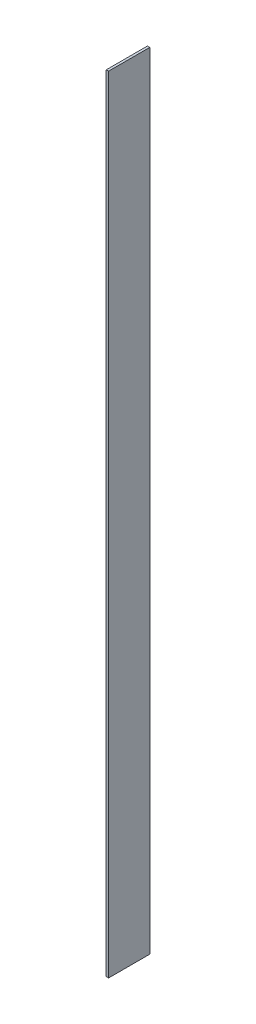
ISO-10303-21;
HEADER;
FILE_DESCRIPTION(('STEP AP214'),'2;1');
FILE_NAME('part.step','',(''),(''),'','','');
FILE_SCHEMA(('AUTOMOTIVE_DESIGN { 1 0 10303 214 1 1 1 1 }'));
ENDSEC;
DATA;
#1=APPLICATION_CONTEXT('core data for automotive mechanical design processes');
#2=APPLICATION_PROTOCOL_DEFINITION('international standard','automotive_design',2000,#1);
#3=PRODUCT_CONTEXT('',#1,'mechanical');
#4=PRODUCT('Part','Part','',(#3));
#5=PRODUCT_RELATED_PRODUCT_CATEGORY('part','',(#4));
#6=PRODUCT_DEFINITION_FORMATION('','',#4);
#7=PRODUCT_DEFINITION_CONTEXT('part definition',#1,'design');
#8=PRODUCT_DEFINITION('design','',#6,#7);
#9=PRODUCT_DEFINITION_SHAPE('','',#8);
#10=(LENGTH_UNIT() NAMED_UNIT(*) SI_UNIT(.MILLI.,.METRE.));
#11=(NAMED_UNIT(*) PLANE_ANGLE_UNIT() SI_UNIT($,.RADIAN.));
#12=(NAMED_UNIT(*) SI_UNIT($,.STERADIAN.) SOLID_ANGLE_UNIT());
#13=UNCERTAINTY_MEASURE_WITH_UNIT(LENGTH_MEASURE(1.E-05),#10,'distance_accuracy_value','');
#14=(GEOMETRIC_REPRESENTATION_CONTEXT(3) GLOBAL_UNCERTAINTY_ASSIGNED_CONTEXT((#13)) GLOBAL_UNIT_ASSIGNED_CONTEXT((#10,
#11,#12)) REPRESENTATION_CONTEXT('',''));
#15=CARTESIAN_POINT('',(0.,0.,0.));
#16=DIRECTION('',(0.,0.,1.));
#17=DIRECTION('',(1.,0.,0.));
#18=AXIS2_PLACEMENT_3D('',#15,#16,#17);
#19=CARTESIAN_POINT('',(0.6,-200.,10.5));
#20=DIRECTION('',(0.,0.,-1.));
#21=DIRECTION('',(-1.,0.,0.));
#22=AXIS2_PLACEMENT_3D('',#19,#20,#21);
#23=PLANE('',#22);
#24=DIRECTION('',(0.,-1.,0.));
#25=VECTOR('',#24,1.);
#26=CARTESIAN_POINT('',(-0.6,-200.,10.5));
#27=LINE('',#26,#25);
#28=CARTESIAN_POINT('',(-0.6,200.,10.5));
#29=VERTEX_POINT('',#28);
#30=CARTESIAN_POINT('',(-0.6,-200.,10.5));
#31=VERTEX_POINT('',#30);
#32=EDGE_CURVE('E107',#29,#31,#27,.T.);
#33=ORIENTED_EDGE('',*,*,#32,.T.);
#34=DIRECTION('',(-1.,0.,0.));
#35=VECTOR('',#34,1.);
#36=CARTESIAN_POINT('',(0.6,-200.,10.5));
#37=LINE('',#36,#35);
#38=CARTESIAN_POINT('',(0.6,-200.,10.5));
#39=VERTEX_POINT('',#38);
#40=EDGE_CURVE('E11',#39,#31,#37,.T.);
#41=ORIENTED_EDGE('',*,*,#40,.F.);
#42=DIRECTION('',(0.,-1.,0.));
#43=VECTOR('',#42,1.);
#44=CARTESIAN_POINT('',(0.6,-200.,10.5));
#45=LINE('',#44,#43);
#46=CARTESIAN_POINT('',(0.6,200.,10.5));
#47=VERTEX_POINT('',#46);
#48=EDGE_CURVE('E91',#47,#39,#45,.T.);
#49=ORIENTED_EDGE('',*,*,#48,.F.);
#50=DIRECTION('',(-1.,0.,0.));
#51=VECTOR('',#50,1.);
#52=CARTESIAN_POINT('',(0.6,200.,10.5));
#53=LINE('',#52,#51);
#54=EDGE_CURVE('E103',#47,#29,#53,.T.);
#55=ORIENTED_EDGE('',*,*,#54,.T.);
#56=EDGE_LOOP('',(#33,#41,#49,#55));
#57=FACE_BOUND('',#56,.T.);
#58=ADVANCED_FACE('F39',(#57),#23,.F.);
#59=CARTESIAN_POINT('',(0.6,-200.,-10.5));
#60=DIRECTION('',(0.,1.,0.));
#61=DIRECTION('',(0.,0.,1.));
#62=AXIS2_PLACEMENT_3D('',#59,#60,#61);
#63=PLANE('',#62);
#64=DIRECTION('',(0.,0.,-1.));
#65=VECTOR('',#64,1.);
#66=CARTESIAN_POINT('',(-0.6,-200.,-10.5));
#67=LINE('',#66,#65);
#68=CARTESIAN_POINT('',(-0.6,-200.,-10.5));
#69=VERTEX_POINT('',#68);
#70=EDGE_CURVE('E96',#31,#69,#67,.T.);
#71=ORIENTED_EDGE('',*,*,#70,.T.);
#72=DIRECTION('',(-1.,0.,0.));
#73=VECTOR('',#72,1.);
#74=CARTESIAN_POINT('',(0.6,-200.,-10.5));
#75=LINE('',#74,#73);
#76=CARTESIAN_POINT('',(0.6,-200.,-10.5));
#77=VERTEX_POINT('',#76);
#78=EDGE_CURVE('E48',#77,#69,#75,.T.);
#79=ORIENTED_EDGE('',*,*,#78,.F.);
#80=DIRECTION('',(0.,0.,-1.));
#81=VECTOR('',#80,1.);
#82=CARTESIAN_POINT('',(0.6,-200.,-10.5));
#83=LINE('',#82,#81);
#84=EDGE_CURVE('E86',#39,#77,#83,.T.);
#85=ORIENTED_EDGE('',*,*,#84,.F.);
#86=ORIENTED_EDGE('',*,*,#40,.T.);
#87=EDGE_LOOP('',(#71,#79,#85,#86));
#88=FACE_BOUND('',#87,.T.);
#89=ADVANCED_FACE('F95',(#88),#63,.F.);
#90=CARTESIAN_POINT('',(0.6,-200.,-10.5));
#91=DIRECTION('',(0.,0.,1.));
#92=DIRECTION('',(1.,0.,0.));
#93=AXIS2_PLACEMENT_3D('',#90,#91,#92);
#94=PLANE('',#93);
#95=DIRECTION('',(0.,1.,0.));
#96=VECTOR('',#95,1.);
#97=CARTESIAN_POINT('',(-0.6,-200.,-10.5));
#98=LINE('',#97,#96);
#99=CARTESIAN_POINT('',(-0.6,200.,-10.5));
#100=VERTEX_POINT('',#99);
#101=EDGE_CURVE('E73',#69,#100,#98,.T.);
#102=ORIENTED_EDGE('',*,*,#101,.T.);
#103=DIRECTION('',(-1.,0.,0.));
#104=VECTOR('',#103,1.);
#105=CARTESIAN_POINT('',(0.6,200.,-10.5));
#106=LINE('',#105,#104);
#107=CARTESIAN_POINT('',(0.6,200.,-10.5));
#108=VERTEX_POINT('',#107);
#109=EDGE_CURVE('E98',#108,#100,#106,.T.);
#110=ORIENTED_EDGE('',*,*,#109,.F.);
#111=DIRECTION('',(0.,1.,0.));
#112=VECTOR('',#111,1.);
#113=CARTESIAN_POINT('',(0.6,-200.,-10.5));
#114=LINE('',#113,#112);
#115=EDGE_CURVE('E89',#77,#108,#114,.T.);
#116=ORIENTED_EDGE('',*,*,#115,.F.);
#117=ORIENTED_EDGE('',*,*,#78,.T.);
#118=EDGE_LOOP('',(#102,#110,#116,#117));
#119=FACE_BOUND('',#118,.T.);
#120=ADVANCED_FACE('F99',(#119),#94,.F.);
#121=CARTESIAN_POINT('',(0.6,200.,-10.5));
#122=DIRECTION('',(0.,-1.,0.));
#123=DIRECTION('',(0.,0.,-1.));
#124=AXIS2_PLACEMENT_3D('',#121,#122,#123);
#125=PLANE('',#124);
#126=DIRECTION('',(0.,0.,1.));
#127=VECTOR('',#126,1.);
#128=CARTESIAN_POINT('',(-0.6,200.,-10.5));
#129=LINE('',#128,#127);
#130=EDGE_CURVE('E79',#100,#29,#129,.T.);
#131=ORIENTED_EDGE('',*,*,#130,.T.);
#132=ORIENTED_EDGE('',*,*,#54,.F.);
#133=DIRECTION('',(0.,0.,1.));
#134=VECTOR('',#133,1.);
#135=CARTESIAN_POINT('',(0.6,200.,-10.5));
#136=LINE('',#135,#134);
#137=EDGE_CURVE('E56',#108,#47,#136,.T.);
#138=ORIENTED_EDGE('',*,*,#137,.F.);
#139=ORIENTED_EDGE('',*,*,#109,.T.);
#140=EDGE_LOOP('',(#131,#132,#138,#139));
#141=FACE_BOUND('',#140,.T.);
#142=ADVANCED_FACE('F120',(#141),#125,.F.);
#143=CARTESIAN_POINT('',(0.6,0.,0.));
#144=DIRECTION('',(1.,0.,0.));
#145=DIRECTION('',(0.,0.,-1.));
#146=AXIS2_PLACEMENT_3D('',#143,#144,#145);
#147=PLANE('',#146);
#148=ORIENTED_EDGE('',*,*,#48,.T.);
#149=ORIENTED_EDGE('',*,*,#84,.T.);
#150=ORIENTED_EDGE('',*,*,#115,.T.);
#151=ORIENTED_EDGE('',*,*,#137,.T.);
#152=EDGE_LOOP('',(#148,#149,#150,#151));
#153=FACE_BOUND('',#152,.T.);
#154=ADVANCED_FACE('F87',(#153),#147,.T.);
#155=CARTESIAN_POINT('',(-0.6,0.,0.));
#156=DIRECTION('',(1.,0.,0.));
#157=DIRECTION('',(0.,0.,-1.));
#158=AXIS2_PLACEMENT_3D('',#155,#156,#157);
#159=PLANE('',#158);
#160=ORIENTED_EDGE('',*,*,#32,.F.);
#161=ORIENTED_EDGE('',*,*,#130,.F.);
#162=ORIENTED_EDGE('',*,*,#101,.F.);
#163=ORIENTED_EDGE('',*,*,#70,.F.);
#164=EDGE_LOOP('',(#160,#161,#162,#163));
#165=FACE_BOUND('',#164,.T.);
#166=ADVANCED_FACE('F123',(#165),#159,.F.);
#167=CLOSED_SHELL('',(#58,#89,#120,#142,#154,#166));
#168=MANIFOLD_SOLID_BREP('B2',#167);
#169=ADVANCED_BREP_SHAPE_REPRESENTATION('',(#18,#168),#14);
#170=SHAPE_DEFINITION_REPRESENTATION(#9,#169);
ENDSEC;
END-ISO-10303-21;
